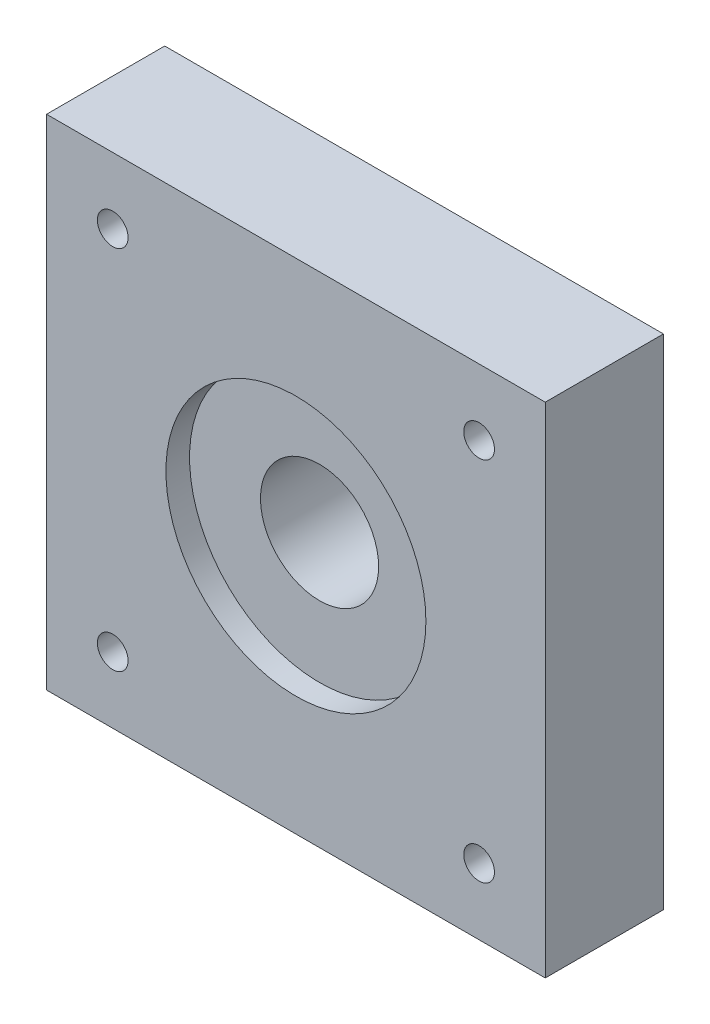
ISO-10303-21;
HEADER;
FILE_DESCRIPTION(('STEP AP214'),'2;1');
FILE_NAME('part.step','',(''),(''),'','','');
FILE_SCHEMA(('AUTOMOTIVE_DESIGN { 1 0 10303 214 1 1 1 1 }'));
ENDSEC;
DATA;
#1=APPLICATION_CONTEXT('core data for automotive mechanical design processes');
#2=APPLICATION_PROTOCOL_DEFINITION('international standard','automotive_design',2000,#1);
#3=PRODUCT_CONTEXT('',#1,'mechanical');
#4=PRODUCT('Part','Part','',(#3));
#5=PRODUCT_RELATED_PRODUCT_CATEGORY('part','',(#4));
#6=PRODUCT_DEFINITION_FORMATION('','',#4);
#7=PRODUCT_DEFINITION_CONTEXT('part definition',#1,'design');
#8=PRODUCT_DEFINITION('design','',#6,#7);
#9=PRODUCT_DEFINITION_SHAPE('','',#8);
#10=(LENGTH_UNIT() NAMED_UNIT(*) SI_UNIT(.MILLI.,.METRE.));
#11=(NAMED_UNIT(*) PLANE_ANGLE_UNIT() SI_UNIT($,.RADIAN.));
#12=(NAMED_UNIT(*) SI_UNIT($,.STERADIAN.) SOLID_ANGLE_UNIT());
#13=UNCERTAINTY_MEASURE_WITH_UNIT(LENGTH_MEASURE(1.E-05),#10,'distance_accuracy_value','');
#14=(GEOMETRIC_REPRESENTATION_CONTEXT(3) GLOBAL_UNCERTAINTY_ASSIGNED_CONTEXT((#13)) GLOBAL_UNIT_ASSIGNED_CONTEXT((#10,
#11,#12)) REPRESENTATION_CONTEXT('',''));
#15=CARTESIAN_POINT('',(0.,0.,0.));
#16=DIRECTION('',(0.,0.,1.));
#17=DIRECTION('',(1.,0.,0.));
#18=AXIS2_PLACEMENT_3D('',#15,#16,#17);
#19=CARTESIAN_POINT('',(21.1,-21.1,10.));
#20=DIRECTION('',(-1.,0.,0.));
#21=DIRECTION('',(0.,0.,1.));
#22=AXIS2_PLACEMENT_3D('',#19,#20,#21);
#23=PLANE('',#22);
#24=DIRECTION('',(0.,1.,0.));
#25=VECTOR('',#24,1.);
#26=CARTESIAN_POINT('',(21.1,-21.1,0.));
#27=LINE('',#26,#25);
#28=CARTESIAN_POINT('',(21.1,-21.1,0.));
#29=VERTEX_POINT('',#28);
#30=CARTESIAN_POINT('',(21.1,21.1,0.));
#31=VERTEX_POINT('',#30);
#32=EDGE_CURVE('E99',#29,#31,#27,.T.);
#33=ORIENTED_EDGE('',*,*,#32,.T.);
#34=DIRECTION('',(0.,0.,-1.));
#35=VECTOR('',#34,1.);
#36=CARTESIAN_POINT('',(21.1,21.1,10.));
#37=LINE('',#36,#35);
#38=CARTESIAN_POINT('',(21.1,21.1,10.));
#39=VERTEX_POINT('',#38);
#40=EDGE_CURVE('E11',#39,#31,#37,.T.);
#41=ORIENTED_EDGE('',*,*,#40,.F.);
#42=DIRECTION('',(0.,1.,0.));
#43=VECTOR('',#42,1.);
#44=CARTESIAN_POINT('',(21.1,-21.1,10.));
#45=LINE('',#44,#43);
#46=CARTESIAN_POINT('',(21.1,-21.1,10.));
#47=VERTEX_POINT('',#46);
#48=EDGE_CURVE('E86',#47,#39,#45,.T.);
#49=ORIENTED_EDGE('',*,*,#48,.F.);
#50=DIRECTION('',(0.,0.,-1.));
#51=VECTOR('',#50,1.);
#52=CARTESIAN_POINT('',(21.1,-21.1,10.));
#53=LINE('',#52,#51);
#54=EDGE_CURVE('E95',#47,#29,#53,.T.);
#55=ORIENTED_EDGE('',*,*,#54,.T.);
#56=EDGE_LOOP('',(#33,#41,#49,#55));
#57=FACE_BOUND('',#56,.T.);
#58=ADVANCED_FACE('F33',(#57),#23,.F.);
#59=CARTESIAN_POINT('',(-21.1,21.1,10.));
#60=DIRECTION('',(0.,-1.,0.));
#61=DIRECTION('',(0.,0.,-1.));
#62=AXIS2_PLACEMENT_3D('',#59,#60,#61);
#63=PLANE('',#62);
#64=DIRECTION('',(-1.,0.,0.));
#65=VECTOR('',#64,1.);
#66=CARTESIAN_POINT('',(-21.1,21.1,0.));
#67=LINE('',#66,#65);
#68=CARTESIAN_POINT('',(-21.1,21.1,0.));
#69=VERTEX_POINT('',#68);
#70=EDGE_CURVE('E90',#31,#69,#67,.T.);
#71=ORIENTED_EDGE('',*,*,#70,.T.);
#72=DIRECTION('',(0.,0.,-1.));
#73=VECTOR('',#72,1.);
#74=CARTESIAN_POINT('',(-21.1,21.1,10.));
#75=LINE('',#74,#73);
#76=CARTESIAN_POINT('',(-21.1,21.1,10.));
#77=VERTEX_POINT('',#76);
#78=EDGE_CURVE('E42',#77,#69,#75,.T.);
#79=ORIENTED_EDGE('',*,*,#78,.F.);
#80=DIRECTION('',(-1.,0.,0.));
#81=VECTOR('',#80,1.);
#82=CARTESIAN_POINT('',(-21.1,21.1,10.));
#83=LINE('',#82,#81);
#84=EDGE_CURVE('E81',#39,#77,#83,.T.);
#85=ORIENTED_EDGE('',*,*,#84,.F.);
#86=ORIENTED_EDGE('',*,*,#40,.T.);
#87=EDGE_LOOP('',(#71,#79,#85,#86));
#88=FACE_BOUND('',#87,.T.);
#89=ADVANCED_FACE('F89',(#88),#63,.F.);
#90=CARTESIAN_POINT('',(-21.1,-21.1,10.));
#91=DIRECTION('',(1.,0.,0.));
#92=DIRECTION('',(0.,0.,-1.));
#93=AXIS2_PLACEMENT_3D('',#90,#91,#92);
#94=PLANE('',#93);
#95=DIRECTION('',(0.,-1.,0.));
#96=VECTOR('',#95,1.);
#97=CARTESIAN_POINT('',(-21.1,-21.1,0.));
#98=LINE('',#97,#96);
#99=CARTESIAN_POINT('',(-21.1,-21.1,0.));
#100=VERTEX_POINT('',#99);
#101=EDGE_CURVE('E68',#69,#100,#98,.T.);
#102=ORIENTED_EDGE('',*,*,#101,.T.);
#103=DIRECTION('',(0.,0.,-1.));
#104=VECTOR('',#103,1.);
#105=CARTESIAN_POINT('',(-21.1,-21.1,10.));
#106=LINE('',#105,#104);
#107=CARTESIAN_POINT('',(-21.1,-21.1,10.));
#108=VERTEX_POINT('',#107);
#109=EDGE_CURVE('E91',#108,#100,#106,.T.);
#110=ORIENTED_EDGE('',*,*,#109,.F.);
#111=DIRECTION('',(0.,-1.,0.));
#112=VECTOR('',#111,1.);
#113=CARTESIAN_POINT('',(-21.1,-21.1,10.));
#114=LINE('',#113,#112);
#115=EDGE_CURVE('E84',#77,#108,#114,.T.);
#116=ORIENTED_EDGE('',*,*,#115,.F.);
#117=ORIENTED_EDGE('',*,*,#78,.T.);
#118=EDGE_LOOP('',(#102,#110,#116,#117));
#119=FACE_BOUND('',#118,.T.);
#120=ADVANCED_FACE('F93',(#119),#94,.F.);
#121=CARTESIAN_POINT('',(-21.1,-21.1,10.));
#122=DIRECTION('',(0.,1.,0.));
#123=DIRECTION('',(0.,0.,1.));
#124=AXIS2_PLACEMENT_3D('',#121,#122,#123);
#125=PLANE('',#124);
#126=DIRECTION('',(1.,0.,0.));
#127=VECTOR('',#126,1.);
#128=CARTESIAN_POINT('',(-21.1,-21.1,0.));
#129=LINE('',#128,#127);
#130=EDGE_CURVE('E74',#100,#29,#129,.T.);
#131=ORIENTED_EDGE('',*,*,#130,.T.);
#132=ORIENTED_EDGE('',*,*,#54,.F.);
#133=DIRECTION('',(1.,0.,0.));
#134=VECTOR('',#133,1.);
#135=CARTESIAN_POINT('',(-21.1,-21.1,10.));
#136=LINE('',#135,#134);
#137=EDGE_CURVE('E51',#108,#47,#136,.T.);
#138=ORIENTED_EDGE('',*,*,#137,.F.);
#139=ORIENTED_EDGE('',*,*,#109,.T.);
#140=EDGE_LOOP('',(#131,#132,#138,#139));
#141=FACE_BOUND('',#140,.T.);
#142=ADVANCED_FACE('F195',(#141),#125,.F.);
#143=CARTESIAN_POINT('',(0.,0.,10.));
#144=DIRECTION('',(0.,0.,-1.));
#145=DIRECTION('',(-1.,0.,0.));
#146=AXIS2_PLACEMENT_3D('',#143,#144,#145);
#147=PLANE('',#146);
#148=CARTESIAN_POINT('',(15.5000000000002,15.4999999999989,10.));
#149=DIRECTION('',(0.,0.,1.));
#150=DIRECTION('',(1.,0.,0.));
#151=AXIS2_PLACEMENT_3D('',#148,#149,#150);
#152=CIRCLE('',#151,1.3);
#153=CARTESIAN_POINT('',(16.8000000000002,15.4999999999989,10.));
#154=VERTEX_POINT('',#153);
#155=EDGE_CURVE('E473',#154,#154,#152,.T.);
#156=ORIENTED_EDGE('',*,*,#155,.F.);
#157=EDGE_LOOP('',(#156));
#158=FACE_BOUND('',#157,.T.);
#159=CARTESIAN_POINT('',(-15.499999999999,15.5000000000001,10.));
#160=DIRECTION('',(0.,0.,1.));
#161=DIRECTION('',(1.,0.,0.));
#162=AXIS2_PLACEMENT_3D('',#159,#160,#161);
#163=CIRCLE('',#162,1.3);
#164=CARTESIAN_POINT('',(-14.199999999999,15.5000000000001,10.));
#165=VERTEX_POINT('',#164);
#166=EDGE_CURVE('E468',#165,#165,#163,.T.);
#167=ORIENTED_EDGE('',*,*,#166,.F.);
#168=EDGE_LOOP('',(#167));
#169=FACE_BOUND('',#168,.T.);
#170=CARTESIAN_POINT('',(-15.5000000000001,-15.499999999999,10.));
#171=DIRECTION('',(0.,0.,1.));
#172=DIRECTION('',(1.,0.,0.));
#173=AXIS2_PLACEMENT_3D('',#170,#171,#172);
#174=CIRCLE('',#173,1.3);
#175=CARTESIAN_POINT('',(-14.2000000000001,-15.499999999999,10.));
#176=VERTEX_POINT('',#175);
#177=EDGE_CURVE('E466',#176,#176,#174,.T.);
#178=ORIENTED_EDGE('',*,*,#177,.F.);
#179=EDGE_LOOP('',(#178));
#180=FACE_BOUND('',#179,.T.);
#181=CARTESIAN_POINT('',(15.4999999999991,-15.5,10.));
#182=DIRECTION('',(0.,0.,1.));
#183=DIRECTION('',(1.,0.,0.));
#184=AXIS2_PLACEMENT_3D('',#181,#182,#183);
#185=CIRCLE('',#184,1.3);
#186=CARTESIAN_POINT('',(16.7999999999991,-15.5,10.));
#187=VERTEX_POINT('',#186);
#188=EDGE_CURVE('E117',#187,#187,#185,.T.);
#189=ORIENTED_EDGE('',*,*,#188,.F.);
#190=EDGE_LOOP('',(#189));
#191=FACE_BOUND('',#190,.T.);
#192=CARTESIAN_POINT('',(0.,0.,10.));
#193=DIRECTION('',(0.,0.,1.));
#194=DIRECTION('',(1.,0.,0.));
#195=AXIS2_PLACEMENT_3D('',#192,#193,#194);
#196=CIRCLE('',#195,11.);
#197=CARTESIAN_POINT('',(11.,0.,10.));
#198=VERTEX_POINT('',#197);
#199=EDGE_CURVE('E111',#198,#198,#196,.T.);
#200=ORIENTED_EDGE('',*,*,#199,.F.);
#201=EDGE_LOOP('',(#200));
#202=FACE_BOUND('',#201,.T.);
#203=ORIENTED_EDGE('',*,*,#48,.T.);
#204=ORIENTED_EDGE('',*,*,#84,.T.);
#205=ORIENTED_EDGE('',*,*,#115,.T.);
#206=ORIENTED_EDGE('',*,*,#137,.T.);
#207=EDGE_LOOP('',(#203,#204,#205,#206));
#208=FACE_BOUND('',#207,.T.);
#209=ADVANCED_FACE('F82',(#158,#169,#180,#191,#202,#208),#147,.F.);
#210=CARTESIAN_POINT('',(0.,0.,0.));
#211=DIRECTION('',(0.,0.,-1.));
#212=DIRECTION('',(-1.,0.,0.));
#213=AXIS2_PLACEMENT_3D('',#210,#211,#212);
#214=PLANE('',#213);
#215=CARTESIAN_POINT('',(0.,0.,0.));
#216=DIRECTION('',(0.,0.,-1.));
#217=DIRECTION('',(-1.,0.,0.));
#218=AXIS2_PLACEMENT_3D('',#215,#216,#217);
#219=CIRCLE('',#218,5.);
#220=CARTESIAN_POINT('',(-5.,0.,0.));
#221=VERTEX_POINT('',#220);
#222=EDGE_CURVE('E112',#221,#221,#219,.T.);
#223=ORIENTED_EDGE('',*,*,#222,.F.);
#224=EDGE_LOOP('',(#223));
#225=FACE_BOUND('',#224,.T.);
#226=CARTESIAN_POINT('',(-1.0842021724855E-13,12.5,0.));
#227=DIRECTION('',(0.,0.,-1.));
#228=DIRECTION('',(-1.,0.,0.));
#229=AXIS2_PLACEMENT_3D('',#226,#227,#228);
#230=CIRCLE('',#229,1.6);
#231=CARTESIAN_POINT('',(-1.60000000000011,12.5,0.));
#232=VERTEX_POINT('',#231);
#233=EDGE_CURVE('E142',#232,#232,#230,.T.);
#234=ORIENTED_EDGE('',*,*,#233,.F.);
#235=EDGE_LOOP('',(#234));
#236=FACE_BOUND('',#235,.T.);
#237=CARTESIAN_POINT('',(12.5,0.,0.));
#238=DIRECTION('',(0.,0.,-1.));
#239=DIRECTION('',(-1.,0.,0.));
#240=AXIS2_PLACEMENT_3D('',#237,#238,#239);
#241=CIRCLE('',#240,1.6);
#242=CARTESIAN_POINT('',(10.9,0.,0.));
#243=VERTEX_POINT('',#242);
#244=EDGE_CURVE('E161',#243,#243,#241,.T.);
#245=ORIENTED_EDGE('',*,*,#244,.F.);
#246=EDGE_LOOP('',(#245));
#247=FACE_BOUND('',#246,.T.);
#248=CARTESIAN_POINT('',(0.,-12.5,0.));
#249=DIRECTION('',(0.,0.,-1.));
#250=DIRECTION('',(-1.,0.,0.));
#251=AXIS2_PLACEMENT_3D('',#248,#249,#250);
#252=CIRCLE('',#251,1.6);
#253=CARTESIAN_POINT('',(-1.59999999999998,-12.5,0.));
#254=VERTEX_POINT('',#253);
#255=EDGE_CURVE('E160',#254,#254,#252,.T.);
#256=ORIENTED_EDGE('',*,*,#255,.F.);
#257=EDGE_LOOP('',(#256));
#258=FACE_BOUND('',#257,.T.);
#259=CARTESIAN_POINT('',(15.5,15.5,0.));
#260=DIRECTION('',(0.,0.,-1.));
#261=DIRECTION('',(-1.,0.,0.));
#262=AXIS2_PLACEMENT_3D('',#259,#260,#261);
#263=CIRCLE('',#262,3.);
#264=CARTESIAN_POINT('',(12.5,15.5,0.));
#265=VERTEX_POINT('',#264);
#266=EDGE_CURVE('E173',#265,#265,#263,.T.);
#267=ORIENTED_EDGE('',*,*,#266,.F.);
#268=EDGE_LOOP('',(#267));
#269=FACE_BOUND('',#268,.T.);
#270=CARTESIAN_POINT('',(-15.5,15.5000000000009,0.));
#271=DIRECTION('',(0.,0.,-1.));
#272=DIRECTION('',(-1.,0.,0.));
#273=AXIS2_PLACEMENT_3D('',#270,#271,#272);
#274=CIRCLE('',#273,3.00000000000091);
#275=CARTESIAN_POINT('',(-18.5000000000009,15.5000000000009,0.));
#276=VERTEX_POINT('',#275);
#277=EDGE_CURVE('E143',#276,#276,#274,.T.);
#278=ORIENTED_EDGE('',*,*,#277,.F.);
#279=EDGE_LOOP('',(#278));
#280=FACE_BOUND('',#279,.T.);
#281=CARTESIAN_POINT('',(-15.5000000000009,-15.4999999999991,0.));
#282=DIRECTION('',(0.,0.,-1.));
#283=DIRECTION('',(-1.,0.,0.));
#284=AXIS2_PLACEMENT_3D('',#281,#282,#283);
#285=CIRCLE('',#284,3.00000000000123);
#286=CARTESIAN_POINT('',(-18.5000000000021,-15.4999999999991,0.));
#287=VERTEX_POINT('',#286);
#288=EDGE_CURVE('E149',#287,#287,#285,.T.);
#289=ORIENTED_EDGE('',*,*,#288,.F.);
#290=EDGE_LOOP('',(#289));
#291=FACE_BOUND('',#290,.T.);
#292=CARTESIAN_POINT('',(15.4999999999991,-15.5,0.));
#293=DIRECTION('',(0.,0.,-1.));
#294=DIRECTION('',(-1.,0.,0.));
#295=AXIS2_PLACEMENT_3D('',#292,#293,#294);
#296=CIRCLE('',#295,3.00000000000047);
#297=CARTESIAN_POINT('',(12.4999999999986,-15.5,0.));
#298=VERTEX_POINT('',#297);
#299=EDGE_CURVE('E136',#298,#298,#296,.T.);
#300=ORIENTED_EDGE('',*,*,#299,.F.);
#301=EDGE_LOOP('',(#300));
#302=FACE_BOUND('',#301,.T.);
#303=CARTESIAN_POINT('',(-12.5,0.,0.));
#304=DIRECTION('',(0.,0.,-1.));
#305=DIRECTION('',(-1.,0.,0.));
#306=AXIS2_PLACEMENT_3D('',#303,#304,#305);
#307=CIRCLE('',#306,1.6);
#308=CARTESIAN_POINT('',(-14.1,0.,0.));
#309=VERTEX_POINT('',#308);
#310=EDGE_CURVE('E172',#309,#309,#307,.T.);
#311=ORIENTED_EDGE('',*,*,#310,.F.);
#312=EDGE_LOOP('',(#311));
#313=FACE_BOUND('',#312,.T.);
#314=ORIENTED_EDGE('',*,*,#32,.F.);
#315=ORIENTED_EDGE('',*,*,#130,.F.);
#316=ORIENTED_EDGE('',*,*,#101,.F.);
#317=ORIENTED_EDGE('',*,*,#70,.F.);
#318=EDGE_LOOP('',(#314,#315,#316,#317));
#319=FACE_BOUND('',#318,.T.);
#320=ADVANCED_FACE('F188',(#225,#236,#247,#258,#269,#280,#291,#302,#313,#319),#214,.T.);
#321=CARTESIAN_POINT('',(-12.5,0.,6.));
#322=DIRECTION('',(0.,0.,-1.));
#323=DIRECTION('',(-1.,0.,0.));
#324=AXIS2_PLACEMENT_3D('',#321,#322,#323);
#325=CYLINDRICAL_SURFACE('',#324,1.6);
#326=CARTESIAN_POINT('',(-12.5,0.,6.));
#327=DIRECTION('',(0.,0.,-1.));
#328=DIRECTION('',(-1.,0.,0.));
#329=AXIS2_PLACEMENT_3D('',#326,#327,#328);
#330=CIRCLE('',#329,1.6);
#331=CARTESIAN_POINT('',(-14.1,0.,6.));
#332=VERTEX_POINT('',#331);
#333=EDGE_CURVE('E102',#332,#332,#330,.T.);
#334=ORIENTED_EDGE('',*,*,#333,.F.);
#335=EDGE_LOOP('',(#334));
#336=FACE_BOUND('',#335,.T.);
#337=ORIENTED_EDGE('',*,*,#310,.T.);
#338=EDGE_LOOP('',(#337));
#339=FACE_BOUND('',#338,.T.);
#340=ADVANCED_FACE('F186',(#336,#339),#325,.F.);
#341=CARTESIAN_POINT('',(-12.5,0.,6.));
#342=DIRECTION('',(0.,0.,-1.));
#343=DIRECTION('',(-1.,0.,0.));
#344=AXIS2_PLACEMENT_3D('',#341,#342,#343);
#345=PLANE('',#344);
#346=ORIENTED_EDGE('',*,*,#333,.T.);
#347=EDGE_LOOP('',(#346));
#348=FACE_BOUND('',#347,.T.);
#349=ADVANCED_FACE('F229',(#348),#345,.T.);
#350=CARTESIAN_POINT('',(15.4999999999991,-15.5,6.));
#351=DIRECTION('',(0.,0.,-1.));
#352=DIRECTION('',(-1.,0.,0.));
#353=AXIS2_PLACEMENT_3D('',#350,#351,#352);
#354=CYLINDRICAL_SURFACE('',#353,3.00000000000047);
#355=CARTESIAN_POINT('',(15.4999999999991,-15.5,6.));
#356=DIRECTION('',(0.,0.,-1.));
#357=DIRECTION('',(-1.,0.,0.));
#358=AXIS2_PLACEMENT_3D('',#355,#356,#357);
#359=CIRCLE('',#358,3.00000000000047);
#360=CARTESIAN_POINT('',(12.4999999999986,-15.5,6.));
#361=VERTEX_POINT('',#360);
#362=EDGE_CURVE('E152',#361,#361,#359,.T.);
#363=ORIENTED_EDGE('',*,*,#362,.F.);
#364=EDGE_LOOP('',(#363));
#365=FACE_BOUND('',#364,.T.);
#366=ORIENTED_EDGE('',*,*,#299,.T.);
#367=EDGE_LOOP('',(#366));
#368=FACE_BOUND('',#367,.T.);
#369=ADVANCED_FACE('F240',(#365,#368),#354,.F.);
#370=CARTESIAN_POINT('',(15.4999999999991,-15.5,6.));
#371=DIRECTION('',(0.,0.,-1.));
#372=DIRECTION('',(-1.,0.,0.));
#373=AXIS2_PLACEMENT_3D('',#370,#371,#372);
#374=PLANE('',#373);
#375=CARTESIAN_POINT('',(15.4999999999991,-15.5,6.));
#376=DIRECTION('',(0.,0.,-1.));
#377=DIRECTION('',(-1.,0.,0.));
#378=AXIS2_PLACEMENT_3D('',#375,#376,#377);
#379=CIRCLE('',#378,1.3);
#380=CARTESIAN_POINT('',(14.1999999999991,-15.5,6.));
#381=VERTEX_POINT('',#380);
#382=EDGE_CURVE('E36',#381,#381,#379,.T.);
#383=ORIENTED_EDGE('',*,*,#382,.F.);
#384=EDGE_LOOP('',(#383));
#385=FACE_BOUND('',#384,.T.);
#386=ORIENTED_EDGE('',*,*,#362,.T.);
#387=EDGE_LOOP('',(#386));
#388=FACE_BOUND('',#387,.T.);
#389=ADVANCED_FACE('F250',(#385,#388),#374,.T.);
#390=CARTESIAN_POINT('',(-15.5000000000009,-15.4999999999991,6.));
#391=DIRECTION('',(0.,0.,-1.));
#392=DIRECTION('',(-1.,0.,0.));
#393=AXIS2_PLACEMENT_3D('',#390,#391,#392);
#394=CYLINDRICAL_SURFACE('',#393,3.00000000000123);
#395=CARTESIAN_POINT('',(-15.5000000000009,-15.4999999999991,6.));
#396=DIRECTION('',(0.,0.,-1.));
#397=DIRECTION('',(-1.,0.,0.));
#398=AXIS2_PLACEMENT_3D('',#395,#396,#397);
#399=CIRCLE('',#398,3.00000000000123);
#400=CARTESIAN_POINT('',(-18.5000000000021,-15.4999999999991,6.));
#401=VERTEX_POINT('',#400);
#402=EDGE_CURVE('E146',#401,#401,#399,.T.);
#403=ORIENTED_EDGE('',*,*,#402,.F.);
#404=EDGE_LOOP('',(#403));
#405=FACE_BOUND('',#404,.T.);
#406=ORIENTED_EDGE('',*,*,#288,.T.);
#407=EDGE_LOOP('',(#406));
#408=FACE_BOUND('',#407,.T.);
#409=ADVANCED_FACE('F258',(#405,#408),#394,.F.);
#410=CARTESIAN_POINT('',(-15.5000000000009,-15.4999999999991,6.));
#411=DIRECTION('',(0.,0.,-1.));
#412=DIRECTION('',(-1.,0.,0.));
#413=AXIS2_PLACEMENT_3D('',#410,#411,#412);
#414=PLANE('',#413);
#415=CARTESIAN_POINT('',(-15.5000000000001,-15.499999999999,6.));
#416=DIRECTION('',(0.,0.,-1.));
#417=DIRECTION('',(-1.,0.,0.));
#418=AXIS2_PLACEMENT_3D('',#415,#416,#417);
#419=CIRCLE('',#418,1.3);
#420=CARTESIAN_POINT('',(-16.8000000000001,-15.499999999999,6.));
#421=VERTEX_POINT('',#420);
#422=EDGE_CURVE('E119',#421,#421,#419,.T.);
#423=ORIENTED_EDGE('',*,*,#422,.F.);
#424=EDGE_LOOP('',(#423));
#425=FACE_BOUND('',#424,.T.);
#426=ORIENTED_EDGE('',*,*,#402,.T.);
#427=EDGE_LOOP('',(#426));
#428=FACE_BOUND('',#427,.T.);
#429=ADVANCED_FACE('F263',(#425,#428),#414,.T.);
#430=CARTESIAN_POINT('',(-15.5,15.5000000000009,6.));
#431=DIRECTION('',(0.,0.,-1.));
#432=DIRECTION('',(-1.,0.,0.));
#433=AXIS2_PLACEMENT_3D('',#430,#431,#432);
#434=CYLINDRICAL_SURFACE('',#433,3.00000000000091);
#435=CARTESIAN_POINT('',(-15.5,15.5000000000009,6.));
#436=DIRECTION('',(0.,0.,-1.));
#437=DIRECTION('',(-1.,0.,0.));
#438=AXIS2_PLACEMENT_3D('',#435,#436,#437);
#439=CIRCLE('',#438,3.00000000000091);
#440=CARTESIAN_POINT('',(-18.5000000000009,15.5000000000009,6.));
#441=VERTEX_POINT('',#440);
#442=EDGE_CURVE('E139',#441,#441,#439,.T.);
#443=ORIENTED_EDGE('',*,*,#442,.F.);
#444=EDGE_LOOP('',(#443));
#445=FACE_BOUND('',#444,.T.);
#446=ORIENTED_EDGE('',*,*,#277,.T.);
#447=EDGE_LOOP('',(#446));
#448=FACE_BOUND('',#447,.T.);
#449=ADVANCED_FACE('F271',(#445,#448),#434,.F.);
#450=CARTESIAN_POINT('',(-15.5,15.5000000000009,6.));
#451=DIRECTION('',(0.,0.,-1.));
#452=DIRECTION('',(-1.,0.,0.));
#453=AXIS2_PLACEMENT_3D('',#450,#451,#452);
#454=PLANE('',#453);
#455=CARTESIAN_POINT('',(-15.499999999999,15.5000000000001,6.));
#456=DIRECTION('',(0.,0.,-1.));
#457=DIRECTION('',(-1.,0.,0.));
#458=AXIS2_PLACEMENT_3D('',#455,#456,#457);
#459=CIRCLE('',#458,1.3);
#460=CARTESIAN_POINT('',(-16.799999999999,15.5000000000001,6.));
#461=VERTEX_POINT('',#460);
#462=EDGE_CURVE('E116',#461,#461,#459,.T.);
#463=ORIENTED_EDGE('',*,*,#462,.F.);
#464=EDGE_LOOP('',(#463));
#465=FACE_BOUND('',#464,.T.);
#466=ORIENTED_EDGE('',*,*,#442,.T.);
#467=EDGE_LOOP('',(#466));
#468=FACE_BOUND('',#467,.T.);
#469=ADVANCED_FACE('F276',(#465,#468),#454,.T.);
#470=CARTESIAN_POINT('',(15.5,15.5,6.));
#471=DIRECTION('',(0.,0.,-1.));
#472=DIRECTION('',(-1.,0.,0.));
#473=AXIS2_PLACEMENT_3D('',#470,#471,#472);
#474=CYLINDRICAL_SURFACE('',#473,3.);
#475=CARTESIAN_POINT('',(15.5,15.5,6.));
#476=DIRECTION('',(0.,0.,-1.));
#477=DIRECTION('',(-1.,0.,0.));
#478=AXIS2_PLACEMENT_3D('',#475,#476,#477);
#479=CIRCLE('',#478,3.);
#480=CARTESIAN_POINT('',(12.5,15.5,6.));
#481=VERTEX_POINT('',#480);
#482=EDGE_CURVE('E169',#481,#481,#479,.T.);
#483=ORIENTED_EDGE('',*,*,#482,.F.);
#484=EDGE_LOOP('',(#483));
#485=FACE_BOUND('',#484,.T.);
#486=ORIENTED_EDGE('',*,*,#266,.T.);
#487=EDGE_LOOP('',(#486));
#488=FACE_BOUND('',#487,.T.);
#489=ADVANCED_FACE('F284',(#485,#488),#474,.F.);
#490=CARTESIAN_POINT('',(15.5,15.5,6.));
#491=DIRECTION('',(0.,0.,-1.));
#492=DIRECTION('',(-1.,0.,0.));
#493=AXIS2_PLACEMENT_3D('',#490,#491,#492);
#494=PLANE('',#493);
#495=CARTESIAN_POINT('',(15.5000000000002,15.4999999999989,6.));
#496=DIRECTION('',(0.,0.,-1.));
#497=DIRECTION('',(-1.,0.,0.));
#498=AXIS2_PLACEMENT_3D('',#495,#496,#497);
#499=CIRCLE('',#498,1.3);
#500=CARTESIAN_POINT('',(14.2000000000002,15.4999999999989,6.));
#501=VERTEX_POINT('',#500);
#502=EDGE_CURVE('E113',#501,#501,#499,.T.);
#503=ORIENTED_EDGE('',*,*,#502,.F.);
#504=EDGE_LOOP('',(#503));
#505=FACE_BOUND('',#504,.T.);
#506=ORIENTED_EDGE('',*,*,#482,.T.);
#507=EDGE_LOOP('',(#506));
#508=FACE_BOUND('',#507,.T.);
#509=ADVANCED_FACE('F289',(#505,#508),#494,.T.);
#510=CARTESIAN_POINT('',(0.,-12.5,6.));
#511=DIRECTION('',(0.,0.,-1.));
#512=DIRECTION('',(-1.,0.,0.));
#513=AXIS2_PLACEMENT_3D('',#510,#511,#512);
#514=CYLINDRICAL_SURFACE('',#513,1.6);
#515=CARTESIAN_POINT('',(0.,-12.5,6.));
#516=DIRECTION('',(0.,0.,-1.));
#517=DIRECTION('',(-1.,0.,0.));
#518=AXIS2_PLACEMENT_3D('',#515,#516,#517);
#519=CIRCLE('',#518,1.6);
#520=CARTESIAN_POINT('',(-1.59999999999998,-12.5,6.));
#521=VERTEX_POINT('',#520);
#522=EDGE_CURVE('E176',#521,#521,#519,.T.);
#523=ORIENTED_EDGE('',*,*,#522,.F.);
#524=EDGE_LOOP('',(#523));
#525=FACE_BOUND('',#524,.T.);
#526=ORIENTED_EDGE('',*,*,#255,.T.);
#527=EDGE_LOOP('',(#526));
#528=FACE_BOUND('',#527,.T.);
#529=ADVANCED_FACE('F297',(#525,#528),#514,.F.);
#530=CARTESIAN_POINT('',(0.,-12.5,6.));
#531=DIRECTION('',(0.,0.,-1.));
#532=DIRECTION('',(-1.,0.,0.));
#533=AXIS2_PLACEMENT_3D('',#530,#531,#532);
#534=PLANE('',#533);
#535=ORIENTED_EDGE('',*,*,#522,.T.);
#536=EDGE_LOOP('',(#535));
#537=FACE_BOUND('',#536,.T.);
#538=ADVANCED_FACE('F302',(#537),#534,.T.);
#539=CARTESIAN_POINT('',(12.5,0.,6.));
#540=DIRECTION('',(0.,0.,-1.));
#541=DIRECTION('',(-1.,0.,0.));
#542=AXIS2_PLACEMENT_3D('',#539,#540,#541);
#543=CYLINDRICAL_SURFACE('',#542,1.6);
#544=CARTESIAN_POINT('',(12.5,0.,6.));
#545=DIRECTION('',(0.,0.,-1.));
#546=DIRECTION('',(-1.,0.,0.));
#547=AXIS2_PLACEMENT_3D('',#544,#545,#546);
#548=CIRCLE('',#547,1.6);
#549=CARTESIAN_POINT('',(10.9,0.,6.));
#550=VERTEX_POINT('',#549);
#551=EDGE_CURVE('E157',#550,#550,#548,.T.);
#552=ORIENTED_EDGE('',*,*,#551,.F.);
#553=EDGE_LOOP('',(#552));
#554=FACE_BOUND('',#553,.T.);
#555=ORIENTED_EDGE('',*,*,#244,.T.);
#556=EDGE_LOOP('',(#555));
#557=FACE_BOUND('',#556,.T.);
#558=ADVANCED_FACE('F312',(#554,#557),#543,.F.);
#559=CARTESIAN_POINT('',(12.5,0.,6.));
#560=DIRECTION('',(0.,0.,-1.));
#561=DIRECTION('',(-1.,0.,0.));
#562=AXIS2_PLACEMENT_3D('',#559,#560,#561);
#563=PLANE('',#562);
#564=ORIENTED_EDGE('',*,*,#551,.T.);
#565=EDGE_LOOP('',(#564));
#566=FACE_BOUND('',#565,.T.);
#567=ADVANCED_FACE('F322',(#566),#563,.T.);
#568=CARTESIAN_POINT('',(-1.0842021724855E-13,12.5,6.));
#569=DIRECTION('',(0.,0.,-1.));
#570=DIRECTION('',(-1.,0.,0.));
#571=AXIS2_PLACEMENT_3D('',#568,#569,#570);
#572=CYLINDRICAL_SURFACE('',#571,1.6);
#573=CARTESIAN_POINT('',(-1.0842021724855E-13,12.5,6.));
#574=DIRECTION('',(0.,0.,-1.));
#575=DIRECTION('',(-1.,0.,0.));
#576=AXIS2_PLACEMENT_3D('',#573,#574,#575);
#577=CIRCLE('',#576,1.6);
#578=CARTESIAN_POINT('',(-1.60000000000011,12.5,6.));
#579=VERTEX_POINT('',#578);
#580=EDGE_CURVE('E164',#579,#579,#577,.T.);
#581=ORIENTED_EDGE('',*,*,#580,.F.);
#582=EDGE_LOOP('',(#581));
#583=FACE_BOUND('',#582,.T.);
#584=ORIENTED_EDGE('',*,*,#233,.T.);
#585=EDGE_LOOP('',(#584));
#586=FACE_BOUND('',#585,.T.);
#587=ADVANCED_FACE('F332',(#583,#586),#572,.F.);
#588=CARTESIAN_POINT('',(-1.0842021724855E-13,12.5,6.));
#589=DIRECTION('',(0.,0.,-1.));
#590=DIRECTION('',(-1.,0.,0.));
#591=AXIS2_PLACEMENT_3D('',#588,#589,#590);
#592=PLANE('',#591);
#593=ORIENTED_EDGE('',*,*,#580,.T.);
#594=EDGE_LOOP('',(#593));
#595=FACE_BOUND('',#594,.T.);
#596=ADVANCED_FACE('F342',(#595),#592,.T.);
#597=CARTESIAN_POINT('',(0.,0.,8.));
#598=DIRECTION('',(0.,0.,1.));
#599=DIRECTION('',(1.,0.,0.));
#600=AXIS2_PLACEMENT_3D('',#597,#598,#599);
#601=CYLINDRICAL_SURFACE('',#600,11.);
#602=CARTESIAN_POINT('',(0.,0.,8.));
#603=DIRECTION('',(0.,0.,1.));
#604=DIRECTION('',(1.,0.,0.));
#605=AXIS2_PLACEMENT_3D('',#602,#603,#604);
#606=CIRCLE('',#605,11.);
#607=CARTESIAN_POINT('',(11.,0.,8.));
#608=VERTEX_POINT('',#607);
#609=EDGE_CURVE('E133',#608,#608,#606,.T.);
#610=ORIENTED_EDGE('',*,*,#609,.F.);
#611=EDGE_LOOP('',(#610));
#612=FACE_BOUND('',#611,.T.);
#613=ORIENTED_EDGE('',*,*,#199,.T.);
#614=EDGE_LOOP('',(#613));
#615=FACE_BOUND('',#614,.T.);
#616=ADVANCED_FACE('F352',(#612,#615),#601,.F.);
#617=CARTESIAN_POINT('',(0.,0.,8.));
#618=DIRECTION('',(0.,0.,1.));
#619=DIRECTION('',(1.,0.,0.));
#620=AXIS2_PLACEMENT_3D('',#617,#618,#619);
#621=PLANE('',#620);
#622=CARTESIAN_POINT('',(0.,0.,8.));
#623=DIRECTION('',(0.,0.,1.));
#624=DIRECTION('',(1.,0.,0.));
#625=AXIS2_PLACEMENT_3D('',#622,#623,#624);
#626=CIRCLE('',#625,5.);
#627=CARTESIAN_POINT('',(5.,0.,8.));
#628=VERTEX_POINT('',#627);
#629=EDGE_CURVE('E108',#628,#628,#626,.T.);
#630=ORIENTED_EDGE('',*,*,#629,.F.);
#631=EDGE_LOOP('',(#630));
#632=FACE_BOUND('',#631,.T.);
#633=ORIENTED_EDGE('',*,*,#609,.T.);
#634=EDGE_LOOP('',(#633));
#635=FACE_BOUND('',#634,.T.);
#636=ADVANCED_FACE('F362',(#632,#635),#621,.T.);
#637=CARTESIAN_POINT('',(0.,0.,10.));
#638=DIRECTION('',(0.,0.,-1.));
#639=DIRECTION('',(-1.,0.,0.));
#640=AXIS2_PLACEMENT_3D('',#637,#638,#639);
#641=CYLINDRICAL_SURFACE('',#640,5.);
#642=ORIENTED_EDGE('',*,*,#629,.T.);
#643=EDGE_LOOP('',(#642));
#644=FACE_BOUND('',#643,.T.);
#645=ORIENTED_EDGE('',*,*,#222,.T.);
#646=EDGE_LOOP('',(#645));
#647=FACE_BOUND('',#646,.T.);
#648=ADVANCED_FACE('F377',(#644,#647),#641,.F.);
#649=CARTESIAN_POINT('',(15.5000000000002,15.4999999999989,0.));
#650=DIRECTION('',(0.,0.,1.));
#651=DIRECTION('',(1.,0.,0.));
#652=AXIS2_PLACEMENT_3D('',#649,#650,#651);
#653=CYLINDRICAL_SURFACE('',#652,1.3);
#654=ORIENTED_EDGE('',*,*,#502,.T.);
#655=EDGE_LOOP('',(#654));
#656=FACE_BOUND('',#655,.T.);
#657=ORIENTED_EDGE('',*,*,#155,.T.);
#658=EDGE_LOOP('',(#657));
#659=FACE_BOUND('',#658,.T.);
#660=ADVANCED_FACE('F387',(#656,#659),#653,.F.);
#661=CARTESIAN_POINT('',(-15.499999999999,15.5000000000001,0.));
#662=DIRECTION('',(0.,0.,1.));
#663=DIRECTION('',(1.,0.,0.));
#664=AXIS2_PLACEMENT_3D('',#661,#662,#663);
#665=CYLINDRICAL_SURFACE('',#664,1.3);
#666=ORIENTED_EDGE('',*,*,#462,.T.);
#667=EDGE_LOOP('',(#666));
#668=FACE_BOUND('',#667,.T.);
#669=ORIENTED_EDGE('',*,*,#166,.T.);
#670=EDGE_LOOP('',(#669));
#671=FACE_BOUND('',#670,.T.);
#672=ADVANCED_FACE('F430',(#668,#671),#665,.F.);
#673=CARTESIAN_POINT('',(-15.5000000000001,-15.499999999999,0.));
#674=DIRECTION('',(0.,0.,1.));
#675=DIRECTION('',(1.,0.,0.));
#676=AXIS2_PLACEMENT_3D('',#673,#674,#675);
#677=CYLINDRICAL_SURFACE('',#676,1.3);
#678=ORIENTED_EDGE('',*,*,#422,.T.);
#679=EDGE_LOOP('',(#678));
#680=FACE_BOUND('',#679,.T.);
#681=ORIENTED_EDGE('',*,*,#177,.T.);
#682=EDGE_LOOP('',(#681));
#683=FACE_BOUND('',#682,.T.);
#684=ADVANCED_FACE('F440',(#680,#683),#677,.F.);
#685=CARTESIAN_POINT('',(15.4999999999991,-15.5,0.));
#686=DIRECTION('',(0.,0.,1.));
#687=DIRECTION('',(1.,0.,0.));
#688=AXIS2_PLACEMENT_3D('',#685,#686,#687);
#689=CYLINDRICAL_SURFACE('',#688,1.3);
#690=ORIENTED_EDGE('',*,*,#382,.T.);
#691=EDGE_LOOP('',(#690));
#692=FACE_BOUND('',#691,.T.);
#693=ORIENTED_EDGE('',*,*,#188,.T.);
#694=EDGE_LOOP('',(#693));
#695=FACE_BOUND('',#694,.T.);
#696=ADVANCED_FACE('F450',(#692,#695),#689,.F.);
#697=CLOSED_SHELL('',(#58,#89,#120,#142,#209,#320,#340,#349,#369,#389,#409,#429,#449,#469,#489,
#509,#529,#538,#558,#567,#587,#596,#616,#636,#648,#660,#672,#684,#696));
#698=MANIFOLD_SOLID_BREP('B2',#697);
#699=ADVANCED_BREP_SHAPE_REPRESENTATION('',(#18,#698),#14);
#700=SHAPE_DEFINITION_REPRESENTATION(#9,#699);
ENDSEC;
END-ISO-10303-21;
